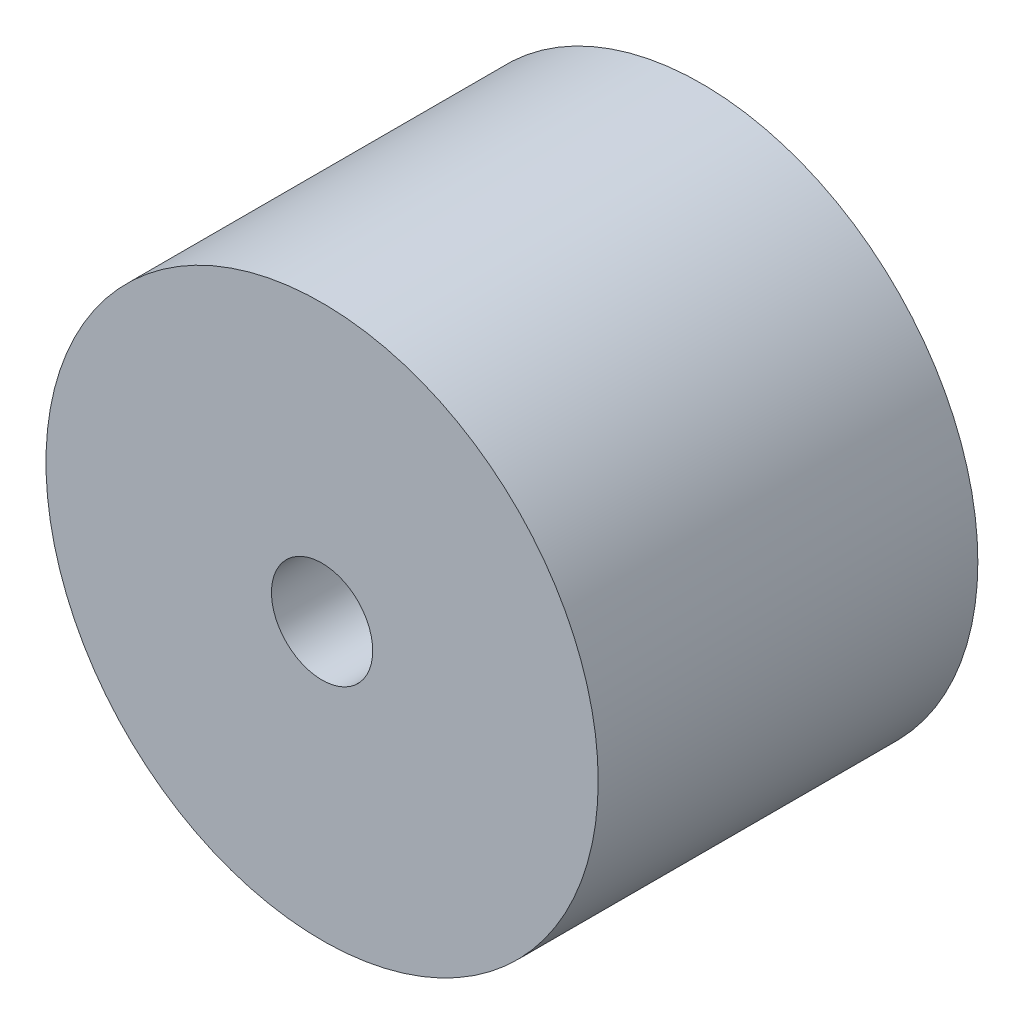
ISO-10303-21;
HEADER;
FILE_DESCRIPTION(('STEP AP214'),'2;1');
FILE_NAME('part.step','',(''),(''),'','','');
FILE_SCHEMA(('AUTOMOTIVE_DESIGN { 1 0 10303 214 1 1 1 1 }'));
ENDSEC;
DATA;
#1=APPLICATION_CONTEXT('core data for automotive mechanical design processes');
#2=APPLICATION_PROTOCOL_DEFINITION('international standard','automotive_design',2000,#1);
#3=PRODUCT_CONTEXT('',#1,'mechanical');
#4=PRODUCT('Part','Part','',(#3));
#5=PRODUCT_RELATED_PRODUCT_CATEGORY('part','',(#4));
#6=PRODUCT_DEFINITION_FORMATION('','',#4);
#7=PRODUCT_DEFINITION_CONTEXT('part definition',#1,'design');
#8=PRODUCT_DEFINITION('design','',#6,#7);
#9=PRODUCT_DEFINITION_SHAPE('','',#8);
#10=(LENGTH_UNIT() NAMED_UNIT(*) SI_UNIT(.MILLI.,.METRE.));
#11=(NAMED_UNIT(*) PLANE_ANGLE_UNIT() SI_UNIT($,.RADIAN.));
#12=(NAMED_UNIT(*) SI_UNIT($,.STERADIAN.) SOLID_ANGLE_UNIT());
#13=UNCERTAINTY_MEASURE_WITH_UNIT(LENGTH_MEASURE(1.E-05),#10,'distance_accuracy_value','');
#14=(GEOMETRIC_REPRESENTATION_CONTEXT(3) GLOBAL_UNCERTAINTY_ASSIGNED_CONTEXT((#13)) GLOBAL_UNIT_ASSIGNED_CONTEXT((#10,
#11,#12)) REPRESENTATION_CONTEXT('',''));
#15=CARTESIAN_POINT('',(0.,0.,0.));
#16=DIRECTION('',(0.,0.,1.));
#17=DIRECTION('',(1.,0.,0.));
#18=AXIS2_PLACEMENT_3D('',#15,#16,#17);
#19=CARTESIAN_POINT('',(0.,0.,30.));
#20=DIRECTION('',(0.,0.,1.));
#21=DIRECTION('',(1.,0.,0.));
#22=AXIS2_PLACEMENT_3D('',#19,#20,#21);
#23=PLANE('',#22);
#24=CARTESIAN_POINT('',(0.,0.,30.));
#25=DIRECTION('',(0.,0.,1.));
#26=DIRECTION('',(1.,0.,0.));
#27=AXIS2_PLACEMENT_3D('',#24,#25,#26);
#28=CIRCLE('',#27,21.8181818181818);
#29=CARTESIAN_POINT('',(21.8181818181818,0.,30.));
#30=VERTEX_POINT('',#29);
#31=EDGE_CURVE('E10',#30,#30,#28,.T.);
#32=ORIENTED_EDGE('',*,*,#31,.T.);
#33=EDGE_LOOP('',(#32));
#34=FACE_BOUND('',#33,.T.);
#35=CARTESIAN_POINT('',(0.,0.,30.));
#36=DIRECTION('',(0.,0.,1.));
#37=DIRECTION('',(1.,0.,0.));
#38=AXIS2_PLACEMENT_3D('',#35,#36,#37);
#39=CIRCLE('',#38,4.);
#40=CARTESIAN_POINT('',(4.,0.,30.));
#41=VERTEX_POINT('',#40);
#42=EDGE_CURVE('E50',#41,#41,#39,.T.);
#43=ORIENTED_EDGE('',*,*,#42,.F.);
#44=EDGE_LOOP('',(#43));
#45=FACE_BOUND('',#44,.T.);
#46=ADVANCED_FACE('F37',(#34,#45),#23,.T.);
#47=CARTESIAN_POINT('',(0.,0.,0.));
#48=DIRECTION('',(0.,0.,1.));
#49=DIRECTION('',(1.,0.,0.));
#50=AXIS2_PLACEMENT_3D('',#47,#48,#49);
#51=PLANE('',#50);
#52=CARTESIAN_POINT('',(0.,0.,0.));
#53=DIRECTION('',(0.,0.,1.));
#54=DIRECTION('',(1.,0.,0.));
#55=AXIS2_PLACEMENT_3D('',#52,#53,#54);
#56=CIRCLE('',#55,21.8181818181818);
#57=CARTESIAN_POINT('',(21.8181818181818,0.,0.));
#58=VERTEX_POINT('',#57);
#59=EDGE_CURVE('E41',#58,#58,#56,.T.);
#60=ORIENTED_EDGE('',*,*,#59,.F.);
#61=EDGE_LOOP('',(#60));
#62=FACE_BOUND('',#61,.T.);
#63=CARTESIAN_POINT('',(0.,0.,0.));
#64=DIRECTION('',(0.,0.,1.));
#65=DIRECTION('',(1.,0.,0.));
#66=AXIS2_PLACEMENT_3D('',#63,#64,#65);
#67=CIRCLE('',#66,4.);
#68=CARTESIAN_POINT('',(4.,0.,0.));
#69=VERTEX_POINT('',#68);
#70=EDGE_CURVE('E52',#69,#69,#67,.T.);
#71=ORIENTED_EDGE('',*,*,#70,.T.);
#72=EDGE_LOOP('',(#71));
#73=FACE_BOUND('',#72,.T.);
#74=ADVANCED_FACE('F64',(#62,#73),#51,.F.);
#75=CARTESIAN_POINT('',(0.,0.,30.));
#76=DIRECTION('',(0.,0.,-1.));
#77=DIRECTION('',(-1.,0.,0.));
#78=AXIS2_PLACEMENT_3D('',#75,#76,#77);
#79=CYLINDRICAL_SURFACE('',#78,21.8181818181818);
#80=ORIENTED_EDGE('',*,*,#31,.F.);
#81=EDGE_LOOP('',(#80));
#82=FACE_BOUND('',#81,.T.);
#83=ORIENTED_EDGE('',*,*,#59,.T.);
#84=EDGE_LOOP('',(#83));
#85=FACE_BOUND('',#84,.T.);
#86=ADVANCED_FACE('F39',(#82,#85),#79,.T.);
#87=CARTESIAN_POINT('',(0.,0.,30.));
#88=DIRECTION('',(0.,0.,-1.));
#89=DIRECTION('',(-1.,0.,0.));
#90=AXIS2_PLACEMENT_3D('',#87,#88,#89);
#91=CYLINDRICAL_SURFACE('',#90,4.);
#92=ORIENTED_EDGE('',*,*,#42,.T.);
#93=EDGE_LOOP('',(#92));
#94=FACE_BOUND('',#93,.T.);
#95=ORIENTED_EDGE('',*,*,#70,.F.);
#96=EDGE_LOOP('',(#95));
#97=FACE_BOUND('',#96,.T.);
#98=ADVANCED_FACE('F60',(#94,#97),#91,.F.);
#99=CLOSED_SHELL('',(#46,#74,#86,#98));
#100=MANIFOLD_SOLID_BREP('B2',#99);
#101=ADVANCED_BREP_SHAPE_REPRESENTATION('',(#18,#100),#14);
#102=SHAPE_DEFINITION_REPRESENTATION(#9,#101);
ENDSEC;
END-ISO-10303-21;
